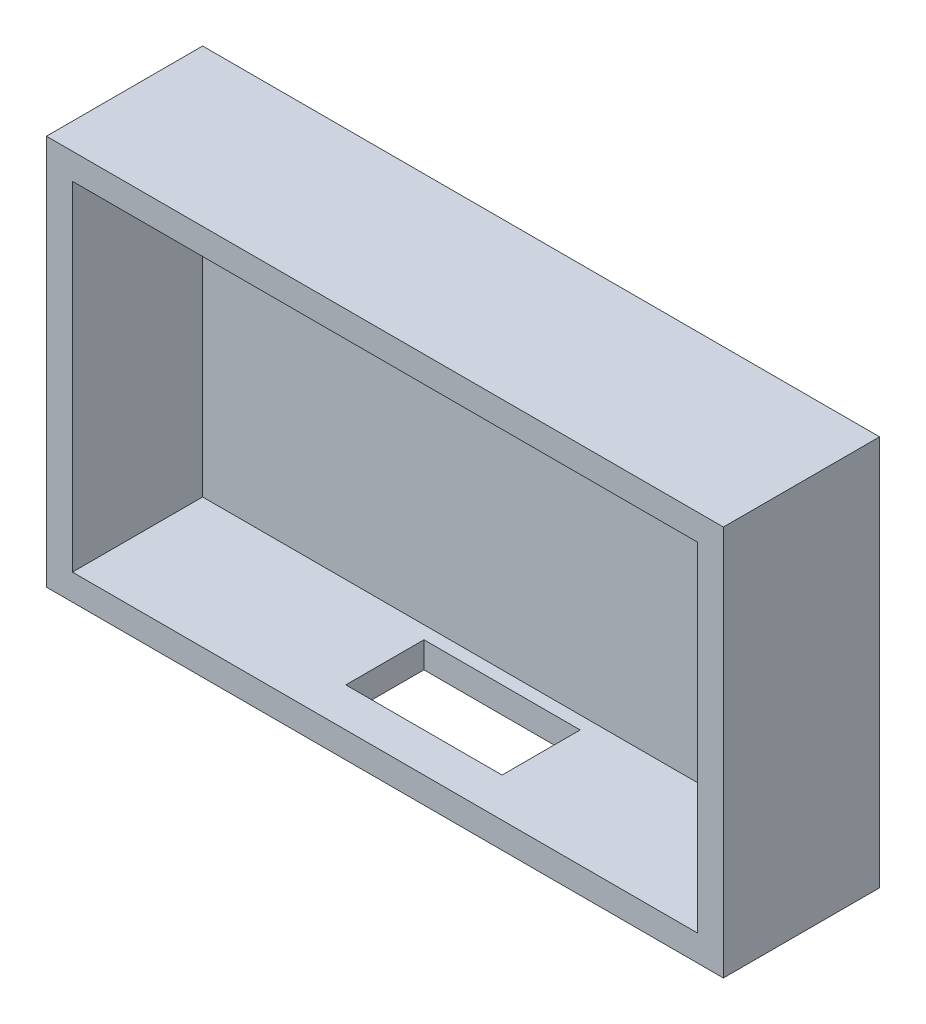
ISO-10303-21;
HEADER;
FILE_DESCRIPTION(('STEP AP214'),'2;1');
FILE_NAME('part.step','',(''),(''),'','','');
FILE_SCHEMA(('AUTOMOTIVE_DESIGN { 1 0 10303 214 1 1 1 1 }'));
ENDSEC;
DATA;
#1=APPLICATION_CONTEXT('core data for automotive mechanical design processes');
#2=APPLICATION_PROTOCOL_DEFINITION('international standard','automotive_design',2000,#1);
#3=PRODUCT_CONTEXT('',#1,'mechanical');
#4=PRODUCT('Part','Part','',(#3));
#5=PRODUCT_RELATED_PRODUCT_CATEGORY('part','',(#4));
#6=PRODUCT_DEFINITION_FORMATION('','',#4);
#7=PRODUCT_DEFINITION_CONTEXT('part definition',#1,'design');
#8=PRODUCT_DEFINITION('design','',#6,#7);
#9=PRODUCT_DEFINITION_SHAPE('','',#8);
#10=(LENGTH_UNIT() NAMED_UNIT(*) SI_UNIT(.MILLI.,.METRE.));
#11=(NAMED_UNIT(*) PLANE_ANGLE_UNIT() SI_UNIT($,.RADIAN.));
#12=(NAMED_UNIT(*) SI_UNIT($,.STERADIAN.) SOLID_ANGLE_UNIT());
#13=UNCERTAINTY_MEASURE_WITH_UNIT(LENGTH_MEASURE(1.E-05),#10,'distance_accuracy_value','');
#14=(GEOMETRIC_REPRESENTATION_CONTEXT(3) GLOBAL_UNCERTAINTY_ASSIGNED_CONTEXT((#13)) GLOBAL_UNIT_ASSIGNED_CONTEXT((#10,
#11,#12)) REPRESENTATION_CONTEXT('',''));
#15=CARTESIAN_POINT('',(0.,0.,0.));
#16=DIRECTION('',(0.,0.,1.));
#17=DIRECTION('',(1.,0.,0.));
#18=AXIS2_PLACEMENT_3D('',#15,#16,#17);
#19=CARTESIAN_POINT('',(0.,75.,0.));
#20=DIRECTION('',(0.,0.,-1.));
#21=DIRECTION('',(-1.,0.,0.));
#22=AXIS2_PLACEMENT_3D('',#19,#20,#21);
#23=PLANE('',#22);
#24=DIRECTION('',(1.,0.,0.));
#25=VECTOR('',#24,1.);
#26=CARTESIAN_POINT('',(0.,0.,0.));
#27=LINE('',#26,#25);
#28=CARTESIAN_POINT('',(0.,0.,0.));
#29=VERTEX_POINT('',#28);
#30=CARTESIAN_POINT('',(130.,0.,0.));
#31=VERTEX_POINT('',#30);
#32=EDGE_CURVE('E195',#29,#31,#27,.T.);
#33=ORIENTED_EDGE('',*,*,#32,.T.);
#34=DIRECTION('',(0.,-1.,0.));
#35=VECTOR('',#34,1.);
#36=CARTESIAN_POINT('',(130.,75.,0.));
#37=LINE('',#36,#35);
#38=CARTESIAN_POINT('',(130.,75.,0.));
#39=VERTEX_POINT('',#38);
#40=EDGE_CURVE('E41',#39,#31,#37,.T.);
#41=ORIENTED_EDGE('',*,*,#40,.F.);
#42=DIRECTION('',(1.,0.,0.));
#43=VECTOR('',#42,1.);
#44=CARTESIAN_POINT('',(0.,75.,0.));
#45=LINE('',#44,#43);
#46=CARTESIAN_POINT('',(0.,75.,0.));
#47=VERTEX_POINT('',#46);
#48=EDGE_CURVE('E185',#47,#39,#45,.T.);
#49=ORIENTED_EDGE('',*,*,#48,.F.);
#50=DIRECTION('',(0.,-1.,0.));
#51=VECTOR('',#50,1.);
#52=CARTESIAN_POINT('',(0.,75.,0.));
#53=LINE('',#52,#51);
#54=EDGE_CURVE('E11',#47,#29,#53,.T.);
#55=ORIENTED_EDGE('',*,*,#54,.T.);
#56=EDGE_LOOP('',(#33,#41,#49,#55));
#57=FACE_BOUND('',#56,.T.);
#58=DIRECTION('',(1.,0.,0.));
#59=VECTOR('',#58,1.);
#60=CARTESIAN_POINT('',(0.,5.,0.));
#61=LINE('',#60,#59);
#62=CARTESIAN_POINT('',(5.,5.,0.));
#63=VERTEX_POINT('',#62);
#64=CARTESIAN_POINT('',(125.,5.,0.));
#65=VERTEX_POINT('',#64);
#66=EDGE_CURVE('E155',#63,#65,#61,.T.);
#67=ORIENTED_EDGE('',*,*,#66,.F.);
#68=DIRECTION('',(0.,-1.,0.));
#69=VECTOR('',#68,1.);
#70=CARTESIAN_POINT('',(5.,75.,0.));
#71=LINE('',#70,#69);
#72=CARTESIAN_POINT('',(5.,70.,0.));
#73=VERTEX_POINT('',#72);
#74=EDGE_CURVE('E174',#73,#63,#71,.T.);
#75=ORIENTED_EDGE('',*,*,#74,.F.);
#76=DIRECTION('',(1.,0.,0.));
#77=VECTOR('',#76,1.);
#78=CARTESIAN_POINT('',(0.,70.,0.));
#79=LINE('',#78,#77);
#80=CARTESIAN_POINT('',(125.,70.,0.));
#81=VERTEX_POINT('',#80);
#82=EDGE_CURVE('E158',#73,#81,#79,.T.);
#83=ORIENTED_EDGE('',*,*,#82,.T.);
#84=DIRECTION('',(0.,-1.,0.));
#85=VECTOR('',#84,1.);
#86=CARTESIAN_POINT('',(125.,75.,0.));
#87=LINE('',#86,#85);
#88=EDGE_CURVE('E171',#81,#65,#87,.T.);
#89=ORIENTED_EDGE('',*,*,#88,.T.);
#90=EDGE_LOOP('',(#67,#75,#83,#89));
#91=FACE_BOUND('',#90,.T.);
#92=ADVANCED_FACE('F33',(#57,#91),#23,.F.);
#93=CARTESIAN_POINT('',(0.,75.,0.));
#94=DIRECTION('',(1.,0.,0.));
#95=DIRECTION('',(0.,0.,-1.));
#96=AXIS2_PLACEMENT_3D('',#93,#94,#95);
#97=PLANE('',#96);
#98=DIRECTION('',(0.,0.,1.));
#99=VECTOR('',#98,1.);
#100=CARTESIAN_POINT('',(0.,0.,0.));
#101=LINE('',#100,#99);
#102=CARTESIAN_POINT('',(0.,0.,-30.));
#103=VERTEX_POINT('',#102);
#104=EDGE_CURVE('E176',#103,#29,#101,.T.);
#105=ORIENTED_EDGE('',*,*,#104,.T.);
#106=ORIENTED_EDGE('',*,*,#54,.F.);
#107=DIRECTION('',(0.,0.,1.));
#108=VECTOR('',#107,1.);
#109=CARTESIAN_POINT('',(0.,75.,0.));
#110=LINE('',#109,#108);
#111=CARTESIAN_POINT('',(0.,75.,-30.));
#112=VERTEX_POINT('',#111);
#113=EDGE_CURVE('E182',#112,#47,#110,.T.);
#114=ORIENTED_EDGE('',*,*,#113,.F.);
#115=DIRECTION('',(0.,-1.,0.));
#116=VECTOR('',#115,1.);
#117=CARTESIAN_POINT('',(0.,75.,-30.));
#118=LINE('',#117,#116);
#119=EDGE_CURVE('E192',#112,#103,#118,.T.);
#120=ORIENTED_EDGE('',*,*,#119,.T.);
#121=EDGE_LOOP('',(#105,#106,#114,#120));
#122=FACE_BOUND('',#121,.T.);
#123=ADVANCED_FACE('F35',(#122),#97,.F.);
#124=CARTESIAN_POINT('',(130.,75.,0.));
#125=DIRECTION('',(-1.,0.,0.));
#126=DIRECTION('',(0.,0.,1.));
#127=AXIS2_PLACEMENT_3D('',#124,#125,#126);
#128=PLANE('',#127);
#129=DIRECTION('',(0.,0.,-1.));
#130=VECTOR('',#129,1.);
#131=CARTESIAN_POINT('',(130.,0.,0.));
#132=LINE('',#131,#130);
#133=CARTESIAN_POINT('',(130.,0.,-30.));
#134=VERTEX_POINT('',#133);
#135=EDGE_CURVE('E197',#31,#134,#132,.T.);
#136=ORIENTED_EDGE('',*,*,#135,.T.);
#137=DIRECTION('',(0.,-1.,0.));
#138=VECTOR('',#137,1.);
#139=CARTESIAN_POINT('',(130.,75.,-30.));
#140=LINE('',#139,#138);
#141=CARTESIAN_POINT('',(130.,75.,-30.));
#142=VERTEX_POINT('',#141);
#143=EDGE_CURVE('E202',#142,#134,#140,.T.);
#144=ORIENTED_EDGE('',*,*,#143,.F.);
#145=DIRECTION('',(0.,0.,-1.));
#146=VECTOR('',#145,1.);
#147=CARTESIAN_POINT('',(130.,75.,0.));
#148=LINE('',#147,#146);
#149=EDGE_CURVE('E188',#39,#142,#148,.T.);
#150=ORIENTED_EDGE('',*,*,#149,.F.);
#151=ORIENTED_EDGE('',*,*,#40,.T.);
#152=EDGE_LOOP('',(#136,#144,#150,#151));
#153=FACE_BOUND('',#152,.T.);
#154=ADVANCED_FACE('F209',(#153),#128,.F.);
#155=CARTESIAN_POINT('',(0.,75.,-30.));
#156=DIRECTION('',(0.,0.,1.));
#157=DIRECTION('',(1.,0.,0.));
#158=AXIS2_PLACEMENT_3D('',#155,#156,#157);
#159=PLANE('',#158);
#160=DIRECTION('',(-1.,0.,0.));
#161=VECTOR('',#160,1.);
#162=CARTESIAN_POINT('',(0.,0.,-30.));
#163=LINE('',#162,#161);
#164=EDGE_CURVE('E186',#134,#103,#163,.T.);
#165=ORIENTED_EDGE('',*,*,#164,.T.);
#166=ORIENTED_EDGE('',*,*,#119,.F.);
#167=DIRECTION('',(-1.,0.,0.));
#168=VECTOR('',#167,1.);
#169=CARTESIAN_POINT('',(0.,75.,-30.));
#170=LINE('',#169,#168);
#171=EDGE_CURVE('E190',#142,#112,#170,.T.);
#172=ORIENTED_EDGE('',*,*,#171,.F.);
#173=ORIENTED_EDGE('',*,*,#143,.T.);
#174=EDGE_LOOP('',(#165,#166,#172,#173));
#175=FACE_BOUND('',#174,.T.);
#176=ADVANCED_FACE('F216',(#175),#159,.F.);
#177=CARTESIAN_POINT('',(0.,75.,0.));
#178=DIRECTION('',(0.,-1.,0.));
#179=DIRECTION('',(0.,0.,-1.));
#180=AXIS2_PLACEMENT_3D('',#177,#178,#179);
#181=PLANE('',#180);
#182=ORIENTED_EDGE('',*,*,#113,.T.);
#183=ORIENTED_EDGE('',*,*,#48,.T.);
#184=ORIENTED_EDGE('',*,*,#149,.T.);
#185=ORIENTED_EDGE('',*,*,#171,.T.);
#186=EDGE_LOOP('',(#182,#183,#184,#185));
#187=FACE_BOUND('',#186,.T.);
#188=ADVANCED_FACE('F222',(#187),#181,.F.);
#189=CARTESIAN_POINT('',(0.,0.,0.));
#190=DIRECTION('',(0.,-1.,0.));
#191=DIRECTION('',(0.,0.,-1.));
#192=AXIS2_PLACEMENT_3D('',#189,#190,#191);
#193=PLANE('',#192);
#194=DIRECTION('',(-1.,0.,0.));
#195=VECTOR('',#194,1.);
#196=CARTESIAN_POINT('',(50.,0.,-7.5));
#197=LINE('',#196,#195);
#198=CARTESIAN_POINT('',(80.,0.,-7.5));
#199=VERTEX_POINT('',#198);
#200=CARTESIAN_POINT('',(50.,0.,-7.5));
#201=VERTEX_POINT('',#200);
#202=EDGE_CURVE('E124',#199,#201,#197,.T.);
#203=ORIENTED_EDGE('',*,*,#202,.F.);
#204=DIRECTION('',(0.,0.,1.));
#205=VECTOR('',#204,1.);
#206=CARTESIAN_POINT('',(80.,0.,-22.5));
#207=LINE('',#206,#205);
#208=CARTESIAN_POINT('',(80.,0.,-22.5));
#209=VERTEX_POINT('',#208);
#210=EDGE_CURVE('E132',#209,#199,#207,.T.);
#211=ORIENTED_EDGE('',*,*,#210,.F.);
#212=DIRECTION('',(1.,0.,0.));
#213=VECTOR('',#212,1.);
#214=CARTESIAN_POINT('',(50.,0.,-22.5));
#215=LINE('',#214,#213);
#216=CARTESIAN_POINT('',(50.,0.,-22.5));
#217=VERTEX_POINT('',#216);
#218=EDGE_CURVE('E48',#217,#209,#215,.T.);
#219=ORIENTED_EDGE('',*,*,#218,.F.);
#220=DIRECTION('',(0.,0.,-1.));
#221=VECTOR('',#220,1.);
#222=CARTESIAN_POINT('',(50.,0.,-22.5));
#223=LINE('',#222,#221);
#224=EDGE_CURVE('E141',#201,#217,#223,.T.);
#225=ORIENTED_EDGE('',*,*,#224,.F.);
#226=EDGE_LOOP('',(#203,#211,#219,#225));
#227=FACE_BOUND('',#226,.T.);
#228=ORIENTED_EDGE('',*,*,#104,.F.);
#229=ORIENTED_EDGE('',*,*,#164,.F.);
#230=ORIENTED_EDGE('',*,*,#135,.F.);
#231=ORIENTED_EDGE('',*,*,#32,.F.);
#232=EDGE_LOOP('',(#228,#229,#230,#231));
#233=FACE_BOUND('',#232,.T.);
#234=ADVANCED_FACE('F138',(#227,#233),#193,.T.);
#235=CARTESIAN_POINT('',(5.,75.,0.));
#236=DIRECTION('',(1.,0.,0.));
#237=DIRECTION('',(0.,0.,-1.));
#238=AXIS2_PLACEMENT_3D('',#235,#236,#237);
#239=PLANE('',#238);
#240=DIRECTION('',(0.,0.,1.));
#241=VECTOR('',#240,1.);
#242=CARTESIAN_POINT('',(5.,5.,0.));
#243=LINE('',#242,#241);
#244=CARTESIAN_POINT('',(5.,5.,-25.));
#245=VERTEX_POINT('',#244);
#246=EDGE_CURVE('E152',#245,#63,#243,.T.);
#247=ORIENTED_EDGE('',*,*,#246,.F.);
#248=DIRECTION('',(0.,-1.,0.));
#249=VECTOR('',#248,1.);
#250=CARTESIAN_POINT('',(5.,75.,-25.));
#251=LINE('',#250,#249);
#252=CARTESIAN_POINT('',(5.,70.,-25.));
#253=VERTEX_POINT('',#252);
#254=EDGE_CURVE('E160',#253,#245,#251,.T.);
#255=ORIENTED_EDGE('',*,*,#254,.F.);
#256=DIRECTION('',(0.,0.,1.));
#257=VECTOR('',#256,1.);
#258=CARTESIAN_POINT('',(5.,70.,0.));
#259=LINE('',#258,#257);
#260=EDGE_CURVE('E156',#253,#73,#259,.T.);
#261=ORIENTED_EDGE('',*,*,#260,.T.);
#262=ORIENTED_EDGE('',*,*,#74,.T.);
#263=EDGE_LOOP('',(#247,#255,#261,#262));
#264=FACE_BOUND('',#263,.T.);
#265=ADVANCED_FACE('F242',(#264),#239,.T.);
#266=CARTESIAN_POINT('',(125.,75.,0.));
#267=DIRECTION('',(-1.,0.,0.));
#268=DIRECTION('',(0.,0.,1.));
#269=AXIS2_PLACEMENT_3D('',#266,#267,#268);
#270=PLANE('',#269);
#271=DIRECTION('',(0.,0.,-1.));
#272=VECTOR('',#271,1.);
#273=CARTESIAN_POINT('',(125.,5.,0.));
#274=LINE('',#273,#272);
#275=CARTESIAN_POINT('',(125.,5.,-25.));
#276=VERTEX_POINT('',#275);
#277=EDGE_CURVE('E166',#65,#276,#274,.T.);
#278=ORIENTED_EDGE('',*,*,#277,.F.);
#279=ORIENTED_EDGE('',*,*,#88,.F.);
#280=DIRECTION('',(0.,0.,-1.));
#281=VECTOR('',#280,1.);
#282=CARTESIAN_POINT('',(125.,70.,0.));
#283=LINE('',#282,#281);
#284=CARTESIAN_POINT('',(125.,70.,-25.));
#285=VERTEX_POINT('',#284);
#286=EDGE_CURVE('E168',#81,#285,#283,.T.);
#287=ORIENTED_EDGE('',*,*,#286,.T.);
#288=DIRECTION('',(0.,-1.,0.));
#289=VECTOR('',#288,1.);
#290=CARTESIAN_POINT('',(125.,75.,-25.));
#291=LINE('',#290,#289);
#292=EDGE_CURVE('E163',#285,#276,#291,.T.);
#293=ORIENTED_EDGE('',*,*,#292,.T.);
#294=EDGE_LOOP('',(#278,#279,#287,#293));
#295=FACE_BOUND('',#294,.T.);
#296=ADVANCED_FACE('F232',(#295),#270,.T.);
#297=CARTESIAN_POINT('',(0.,75.,-25.));
#298=DIRECTION('',(0.,0.,1.));
#299=DIRECTION('',(1.,0.,0.));
#300=AXIS2_PLACEMENT_3D('',#297,#298,#299);
#301=PLANE('',#300);
#302=DIRECTION('',(-1.,0.,0.));
#303=VECTOR('',#302,1.);
#304=CARTESIAN_POINT('',(0.,5.,-25.));
#305=LINE('',#304,#303);
#306=EDGE_CURVE('E159',#276,#245,#305,.T.);
#307=ORIENTED_EDGE('',*,*,#306,.F.);
#308=ORIENTED_EDGE('',*,*,#292,.F.);
#309=DIRECTION('',(-1.,0.,0.));
#310=VECTOR('',#309,1.);
#311=CARTESIAN_POINT('',(0.,70.,-25.));
#312=LINE('',#311,#310);
#313=EDGE_CURVE('E164',#285,#253,#312,.T.);
#314=ORIENTED_EDGE('',*,*,#313,.T.);
#315=ORIENTED_EDGE('',*,*,#254,.T.);
#316=EDGE_LOOP('',(#307,#308,#314,#315));
#317=FACE_BOUND('',#316,.T.);
#318=ADVANCED_FACE('F238',(#317),#301,.T.);
#319=CARTESIAN_POINT('',(0.,70.,0.));
#320=DIRECTION('',(0.,-1.,0.));
#321=DIRECTION('',(0.,0.,-1.));
#322=AXIS2_PLACEMENT_3D('',#319,#320,#321);
#323=PLANE('',#322);
#324=ORIENTED_EDGE('',*,*,#260,.F.);
#325=ORIENTED_EDGE('',*,*,#313,.F.);
#326=ORIENTED_EDGE('',*,*,#286,.F.);
#327=ORIENTED_EDGE('',*,*,#82,.F.);
#328=EDGE_LOOP('',(#324,#325,#326,#327));
#329=FACE_BOUND('',#328,.T.);
#330=ADVANCED_FACE('F245',(#329),#323,.T.);
#331=CARTESIAN_POINT('',(0.,5.,0.));
#332=DIRECTION('',(0.,-1.,0.));
#333=DIRECTION('',(0.,0.,-1.));
#334=AXIS2_PLACEMENT_3D('',#331,#332,#333);
#335=PLANE('',#334);
#336=DIRECTION('',(0.,0.,-1.));
#337=VECTOR('',#336,1.);
#338=CARTESIAN_POINT('',(80.,5.,-22.5));
#339=LINE('',#338,#337);
#340=CARTESIAN_POINT('',(80.,5.,-7.5));
#341=VERTEX_POINT('',#340);
#342=CARTESIAN_POINT('',(80.,5.,-22.5));
#343=VERTEX_POINT('',#342);
#344=EDGE_CURVE('E136',#341,#343,#339,.T.);
#345=ORIENTED_EDGE('',*,*,#344,.F.);
#346=DIRECTION('',(1.,0.,0.));
#347=VECTOR('',#346,1.);
#348=CARTESIAN_POINT('',(50.,5.,-7.5));
#349=LINE('',#348,#347);
#350=CARTESIAN_POINT('',(50.,5.,-7.5));
#351=VERTEX_POINT('',#350);
#352=EDGE_CURVE('E56',#351,#341,#349,.T.);
#353=ORIENTED_EDGE('',*,*,#352,.F.);
#354=DIRECTION('',(0.,0.,1.));
#355=VECTOR('',#354,1.);
#356=CARTESIAN_POINT('',(50.,5.,-22.5));
#357=LINE('',#356,#355);
#358=CARTESIAN_POINT('',(50.,5.,-22.5));
#359=VERTEX_POINT('',#358);
#360=EDGE_CURVE('E357',#359,#351,#357,.T.);
#361=ORIENTED_EDGE('',*,*,#360,.F.);
#362=DIRECTION('',(-1.,0.,0.));
#363=VECTOR('',#362,1.);
#364=CARTESIAN_POINT('',(50.,5.,-22.5));
#365=LINE('',#364,#363);
#366=EDGE_CURVE('E355',#343,#359,#365,.T.);
#367=ORIENTED_EDGE('',*,*,#366,.F.);
#368=EDGE_LOOP('',(#345,#353,#361,#367));
#369=FACE_BOUND('',#368,.T.);
#370=ORIENTED_EDGE('',*,*,#246,.T.);
#371=ORIENTED_EDGE('',*,*,#66,.T.);
#372=ORIENTED_EDGE('',*,*,#277,.T.);
#373=ORIENTED_EDGE('',*,*,#306,.T.);
#374=EDGE_LOOP('',(#370,#371,#372,#373));
#375=FACE_BOUND('',#374,.T.);
#376=ADVANCED_FACE('F229',(#369,#375),#335,.F.);
#377=CARTESIAN_POINT('',(50.,75.001,-7.5));
#378=DIRECTION('',(0.,0.,1.));
#379=DIRECTION('',(1.,0.,0.));
#380=AXIS2_PLACEMENT_3D('',#377,#378,#379);
#381=PLANE('',#380);
#382=ORIENTED_EDGE('',*,*,#352,.T.);
#383=DIRECTION('',(0.,-1.,0.));
#384=VECTOR('',#383,1.);
#385=CARTESIAN_POINT('',(80.,75.001,-7.5));
#386=LINE('',#385,#384);
#387=EDGE_CURVE('E120',#341,#199,#386,.T.);
#388=ORIENTED_EDGE('',*,*,#387,.T.);
#389=ORIENTED_EDGE('',*,*,#202,.T.);
#390=DIRECTION('',(0.,-1.,0.));
#391=VECTOR('',#390,1.);
#392=CARTESIAN_POINT('',(50.,75.001,-7.5));
#393=LINE('',#392,#391);
#394=EDGE_CURVE('E129',#351,#201,#393,.T.);
#395=ORIENTED_EDGE('',*,*,#394,.F.);
#396=EDGE_LOOP('',(#382,#388,#389,#395));
#397=FACE_BOUND('',#396,.T.);
#398=ADVANCED_FACE('F122',(#397),#381,.F.);
#399=CARTESIAN_POINT('',(50.,75.001,-22.5));
#400=DIRECTION('',(-1.,0.,0.));
#401=DIRECTION('',(0.,0.,1.));
#402=AXIS2_PLACEMENT_3D('',#399,#400,#401);
#403=PLANE('',#402);
#404=ORIENTED_EDGE('',*,*,#360,.T.);
#405=ORIENTED_EDGE('',*,*,#394,.T.);
#406=ORIENTED_EDGE('',*,*,#224,.T.);
#407=DIRECTION('',(0.,-1.,0.));
#408=VECTOR('',#407,1.);
#409=CARTESIAN_POINT('',(50.,75.001,-22.5));
#410=LINE('',#409,#408);
#411=EDGE_CURVE('E148',#359,#217,#410,.T.);
#412=ORIENTED_EDGE('',*,*,#411,.F.);
#413=EDGE_LOOP('',(#404,#405,#406,#412));
#414=FACE_BOUND('',#413,.T.);
#415=ADVANCED_FACE('F323',(#414),#403,.F.);
#416=CARTESIAN_POINT('',(50.,75.001,-22.5));
#417=DIRECTION('',(0.,0.,-1.));
#418=DIRECTION('',(-1.,0.,0.));
#419=AXIS2_PLACEMENT_3D('',#416,#417,#418);
#420=PLANE('',#419);
#421=ORIENTED_EDGE('',*,*,#366,.T.);
#422=ORIENTED_EDGE('',*,*,#411,.T.);
#423=ORIENTED_EDGE('',*,*,#218,.T.);
#424=DIRECTION('',(0.,-1.,0.));
#425=VECTOR('',#424,1.);
#426=CARTESIAN_POINT('',(80.,75.001,-22.5));
#427=LINE('',#426,#425);
#428=EDGE_CURVE('E134',#343,#209,#427,.T.);
#429=ORIENTED_EDGE('',*,*,#428,.F.);
#430=EDGE_LOOP('',(#421,#422,#423,#429));
#431=FACE_BOUND('',#430,.T.);
#432=ADVANCED_FACE('F332',(#431),#420,.F.);
#433=CARTESIAN_POINT('',(80.,75.001,-22.5));
#434=DIRECTION('',(1.,0.,0.));
#435=DIRECTION('',(0.,0.,-1.));
#436=AXIS2_PLACEMENT_3D('',#433,#434,#435);
#437=PLANE('',#436);
#438=ORIENTED_EDGE('',*,*,#344,.T.);
#439=ORIENTED_EDGE('',*,*,#428,.T.);
#440=ORIENTED_EDGE('',*,*,#210,.T.);
#441=ORIENTED_EDGE('',*,*,#387,.F.);
#442=EDGE_LOOP('',(#438,#439,#440,#441));
#443=FACE_BOUND('',#442,.T.);
#444=ADVANCED_FACE('F133',(#443),#437,.F.);
#445=CLOSED_SHELL('',(#92,#123,#154,#176,#188,#234,#265,#296,#318,#330,#376,#398,#415,#432,#444));
#446=MANIFOLD_SOLID_BREP('B2',#445);
#447=ADVANCED_BREP_SHAPE_REPRESENTATION('',(#18,#446),#14);
#448=SHAPE_DEFINITION_REPRESENTATION(#9,#447);
ENDSEC;
END-ISO-10303-21;
